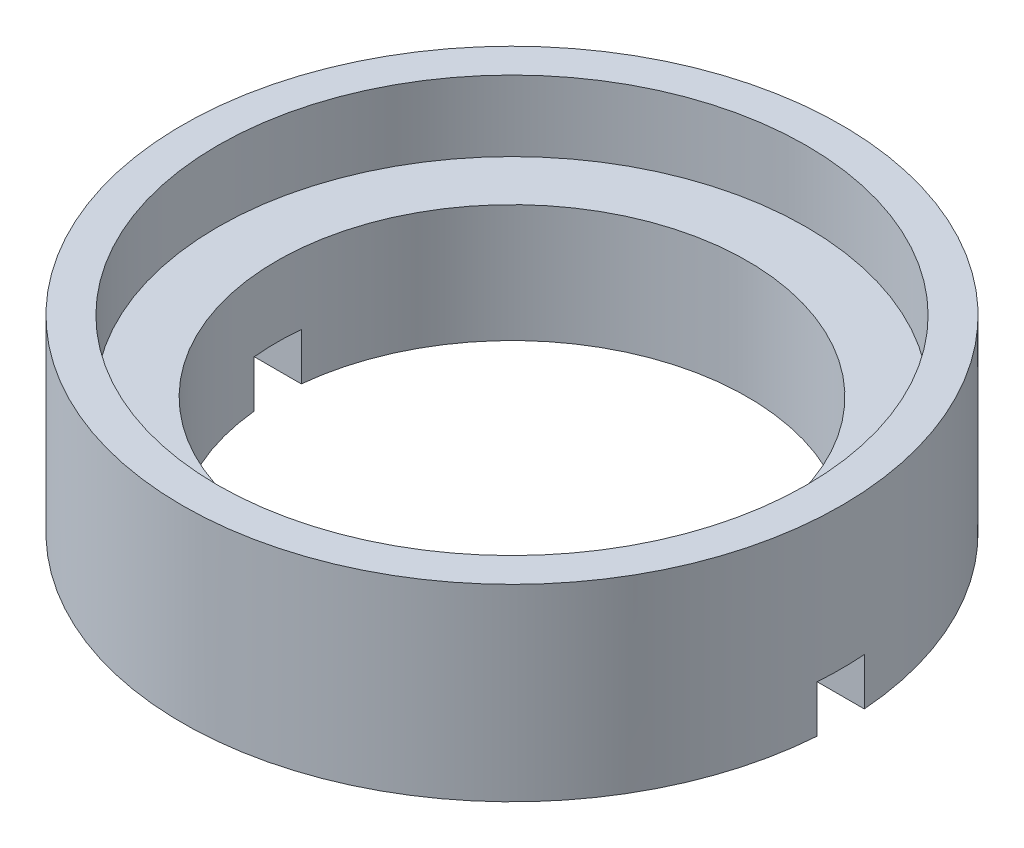
ISO-10303-21;
HEADER;
FILE_DESCRIPTION(('STEP AP214'),'2;1');
FILE_NAME('part.step','',(''),(''),'','','');
FILE_SCHEMA(('AUTOMOTIVE_DESIGN { 1 0 10303 214 1 1 1 1 }'));
ENDSEC;
DATA;
#1=APPLICATION_CONTEXT('core data for automotive mechanical design processes');
#2=APPLICATION_PROTOCOL_DEFINITION('international standard','automotive_design',2000,#1);
#3=PRODUCT_CONTEXT('',#1,'mechanical');
#4=PRODUCT('Part','Part','',(#3));
#5=PRODUCT_RELATED_PRODUCT_CATEGORY('part','',(#4));
#6=PRODUCT_DEFINITION_FORMATION('','',#4);
#7=PRODUCT_DEFINITION_CONTEXT('part definition',#1,'design');
#8=PRODUCT_DEFINITION('design','',#6,#7);
#9=PRODUCT_DEFINITION_SHAPE('','',#8);
#10=(LENGTH_UNIT() NAMED_UNIT(*) SI_UNIT(.MILLI.,.METRE.));
#11=(NAMED_UNIT(*) PLANE_ANGLE_UNIT() SI_UNIT($,.RADIAN.));
#12=(NAMED_UNIT(*) SI_UNIT($,.STERADIAN.) SOLID_ANGLE_UNIT());
#13=UNCERTAINTY_MEASURE_WITH_UNIT(LENGTH_MEASURE(1.E-05),#10,'distance_accuracy_value','');
#14=(GEOMETRIC_REPRESENTATION_CONTEXT(3) GLOBAL_UNCERTAINTY_ASSIGNED_CONTEXT((#13)) GLOBAL_UNIT_ASSIGNED_CONTEXT((#10,
#11,#12)) REPRESENTATION_CONTEXT('',''));
#15=CARTESIAN_POINT('',(0.,0.,0.));
#16=DIRECTION('',(0.,0.,1.));
#17=DIRECTION('',(1.,0.,0.));
#18=AXIS2_PLACEMENT_3D('',#15,#16,#17);
#19=CARTESIAN_POINT('',(0.,0.,0.));
#20=DIRECTION('',(0.,1.,0.));
#21=DIRECTION('',(0.,0.,1.));
#22=AXIS2_PLACEMENT_3D('',#19,#20,#21);
#23=PLANE('',#22);
#24=CARTESIAN_POINT('',(0.,0.,0.));
#25=DIRECTION('',(0.,1.,0.));
#26=DIRECTION('',(0.,0.,1.));
#27=AXIS2_PLACEMENT_3D('',#24,#25,#26);
#28=CIRCLE('',#27,7.);
#29=CARTESIAN_POINT('',(6.98212002188447,0.,-0.5));
#30=VERTEX_POINT('',#29);
#31=CARTESIAN_POINT('',(-6.98212002188447,0.,-0.5));
#32=VERTEX_POINT('',#31);
#33=EDGE_CURVE('E128',#30,#32,#28,.T.);
#34=ORIENTED_EDGE('',*,*,#33,.F.);
#35=DIRECTION('',(1.,0.,0.));
#36=VECTOR('',#35,1.);
#37=CARTESIAN_POINT('',(-8.,0.,-0.5));
#38=LINE('',#37,#36);
#39=CARTESIAN_POINT('',(4.9749371855331,0.,-0.5));
#40=VERTEX_POINT('',#39);
#41=EDGE_CURVE('E122',#40,#30,#38,.T.);
#42=ORIENTED_EDGE('',*,*,#41,.F.);
#43=CARTESIAN_POINT('',(0.,0.,0.));
#44=DIRECTION('',(0.,-1.,0.));
#45=DIRECTION('',(0.,0.,-1.));
#46=AXIS2_PLACEMENT_3D('',#43,#44,#45);
#47=CIRCLE('',#46,5.);
#48=CARTESIAN_POINT('',(-4.9749371855331,0.,-0.5));
#49=VERTEX_POINT('',#48);
#50=EDGE_CURVE('E179',#49,#40,#47,.T.);
#51=ORIENTED_EDGE('',*,*,#50,.F.);
#52=EDGE_CURVE('E163',#32,#49,#38,.T.);
#53=ORIENTED_EDGE('',*,*,#52,.F.);
#54=EDGE_LOOP('',(#34,#42,#51,#53));
#55=FACE_BOUND('',#54,.T.);
#56=ADVANCED_FACE('F39',(#55),#23,.F.);
#57=CARTESIAN_POINT('',(0.,4.,0.));
#58=DIRECTION('',(0.,-1.,0.));
#59=DIRECTION('',(0.,0.,-1.));
#60=AXIS2_PLACEMENT_3D('',#57,#58,#59);
#61=CYLINDRICAL_SURFACE('',#60,7.);
#62=CARTESIAN_POINT('',(0.,1.,0.));
#63=DIRECTION('',(0.,1.,0.));
#64=DIRECTION('',(0.,0.,1.));
#65=AXIS2_PLACEMENT_3D('',#62,#63,#64);
#66=CIRCLE('',#65,7.);
#67=CARTESIAN_POINT('',(6.98212002188447,1.,0.5));
#68=VERTEX_POINT('',#67);
#69=CARTESIAN_POINT('',(6.98212002188447,1.,-0.5));
#70=VERTEX_POINT('',#69);
#71=EDGE_CURVE('E112',#68,#70,#66,.T.);
#72=ORIENTED_EDGE('',*,*,#71,.T.);
#73=DIRECTION('',(0.,-1.,0.));
#74=VECTOR('',#73,1.);
#75=CARTESIAN_POINT('',(6.98212002188447,4.,-0.5));
#76=LINE('',#75,#74);
#77=EDGE_CURVE('E176',#70,#30,#76,.T.);
#78=ORIENTED_EDGE('',*,*,#77,.T.);
#79=ORIENTED_EDGE('',*,*,#33,.T.);
#80=DIRECTION('',(0.,-1.,0.));
#81=VECTOR('',#80,1.);
#82=CARTESIAN_POINT('',(-6.98212002188447,4.,-0.5));
#83=LINE('',#82,#81);
#84=CARTESIAN_POINT('',(-6.98212002188447,1.,-0.5));
#85=VERTEX_POINT('',#84);
#86=EDGE_CURVE('E173',#32,#85,#83,.F.);
#87=ORIENTED_EDGE('',*,*,#86,.T.);
#88=CARTESIAN_POINT('',(-6.98212002188447,1.,0.5));
#89=VERTEX_POINT('',#88);
#90=EDGE_CURVE('E170',#85,#89,#66,.T.);
#91=ORIENTED_EDGE('',*,*,#90,.T.);
#92=DIRECTION('',(0.,-1.,0.));
#93=VECTOR('',#92,1.);
#94=CARTESIAN_POINT('',(-6.98212002188447,4.,0.5));
#95=LINE('',#94,#93);
#96=CARTESIAN_POINT('',(-6.98212002188447,0.,0.5));
#97=VERTEX_POINT('',#96);
#98=EDGE_CURVE('E111',#89,#97,#95,.T.);
#99=ORIENTED_EDGE('',*,*,#98,.T.);
#100=CARTESIAN_POINT('',(6.98212002188447,0.,0.5));
#101=VERTEX_POINT('',#100);
#102=EDGE_CURVE('E119',#97,#101,#28,.T.);
#103=ORIENTED_EDGE('',*,*,#102,.T.);
#104=DIRECTION('',(0.,-1.,0.));
#105=VECTOR('',#104,1.);
#106=CARTESIAN_POINT('',(6.98212002188447,4.,0.5));
#107=LINE('',#106,#105);
#108=EDGE_CURVE('E103',#101,#68,#107,.F.);
#109=ORIENTED_EDGE('',*,*,#108,.T.);
#110=EDGE_LOOP('',(#72,#78,#79,#87,#91,#99,#103,#109));
#111=FACE_BOUND('',#110,.T.);
#112=CARTESIAN_POINT('',(0.,4.,0.));
#113=DIRECTION('',(0.,1.,0.));
#114=DIRECTION('',(0.,0.,1.));
#115=AXIS2_PLACEMENT_3D('',#112,#113,#114);
#116=CIRCLE('',#115,7.);
#117=CARTESIAN_POINT('',(0.,4.,7.));
#118=VERTEX_POINT('',#117);
#119=EDGE_CURVE('E132',#118,#118,#116,.T.);
#120=ORIENTED_EDGE('',*,*,#119,.F.);
#121=EDGE_LOOP('',(#120));
#122=FACE_BOUND('',#121,.T.);
#123=ADVANCED_FACE('F41',(#111,#122),#61,.T.);
#124=CARTESIAN_POINT('',(0.,4.,0.));
#125=DIRECTION('',(0.,1.,0.));
#126=DIRECTION('',(0.,0.,1.));
#127=AXIS2_PLACEMENT_3D('',#124,#125,#126);
#128=PLANE('',#127);
#129=CARTESIAN_POINT('',(0.,4.,0.));
#130=DIRECTION('',(0.,1.,0.));
#131=DIRECTION('',(0.,0.,1.));
#132=AXIS2_PLACEMENT_3D('',#129,#130,#131);
#133=CIRCLE('',#132,6.25);
#134=CARTESIAN_POINT('',(0.,4.,6.25));
#135=VERTEX_POINT('',#134);
#136=EDGE_CURVE('E134',#135,#135,#133,.T.);
#137=ORIENTED_EDGE('',*,*,#136,.F.);
#138=EDGE_LOOP('',(#137));
#139=FACE_BOUND('',#138,.T.);
#140=ORIENTED_EDGE('',*,*,#119,.T.);
#141=EDGE_LOOP('',(#140));
#142=FACE_BOUND('',#141,.T.);
#143=ADVANCED_FACE('F185',(#139,#142),#128,.T.);
#144=ORIENTED_EDGE('',*,*,#102,.F.);
#145=DIRECTION('',(-1.,0.,0.));
#146=VECTOR('',#145,1.);
#147=CARTESIAN_POINT('',(-8.,0.,0.5));
#148=LINE('',#147,#146);
#149=CARTESIAN_POINT('',(-4.9749371855331,0.,0.5));
#150=VERTEX_POINT('',#149);
#151=EDGE_CURVE('E123',#150,#97,#148,.T.);
#152=ORIENTED_EDGE('',*,*,#151,.F.);
#153=CARTESIAN_POINT('',(4.9749371855331,0.,0.5));
#154=VERTEX_POINT('',#153);
#155=EDGE_CURVE('E121',#154,#150,#47,.T.);
#156=ORIENTED_EDGE('',*,*,#155,.F.);
#157=EDGE_CURVE('E106',#101,#154,#148,.T.);
#158=ORIENTED_EDGE('',*,*,#157,.F.);
#159=EDGE_LOOP('',(#144,#152,#156,#158));
#160=FACE_BOUND('',#159,.T.);
#161=ADVANCED_FACE('F117',(#160),#23,.F.);
#162=CARTESIAN_POINT('',(0.,2.5,0.));
#163=DIRECTION('',(0.,1.,0.));
#164=DIRECTION('',(0.,0.,1.));
#165=AXIS2_PLACEMENT_3D('',#162,#163,#164);
#166=CYLINDRICAL_SURFACE('',#165,6.25);
#167=CARTESIAN_POINT('',(0.,2.5,0.));
#168=DIRECTION('',(0.,1.,0.));
#169=DIRECTION('',(0.,0.,1.));
#170=AXIS2_PLACEMENT_3D('',#167,#168,#169);
#171=CIRCLE('',#170,6.25);
#172=CARTESIAN_POINT('',(0.,2.5,6.25));
#173=VERTEX_POINT('',#172);
#174=EDGE_CURVE('E129',#173,#173,#171,.T.);
#175=ORIENTED_EDGE('',*,*,#174,.F.);
#176=EDGE_LOOP('',(#175));
#177=FACE_BOUND('',#176,.T.);
#178=ORIENTED_EDGE('',*,*,#136,.T.);
#179=EDGE_LOOP('',(#178));
#180=FACE_BOUND('',#179,.T.);
#181=ADVANCED_FACE('F183',(#177,#180),#166,.F.);
#182=CARTESIAN_POINT('',(0.,2.5,0.));
#183=DIRECTION('',(0.,1.,0.));
#184=DIRECTION('',(0.,0.,1.));
#185=AXIS2_PLACEMENT_3D('',#182,#183,#184);
#186=PLANE('',#185);
#187=CARTESIAN_POINT('',(0.,2.5,0.));
#188=DIRECTION('',(0.,1.,0.));
#189=DIRECTION('',(0.,0.,1.));
#190=AXIS2_PLACEMENT_3D('',#187,#188,#189);
#191=CIRCLE('',#190,5.);
#192=CARTESIAN_POINT('',(0.,2.5,5.));
#193=VERTEX_POINT('',#192);
#194=EDGE_CURVE('E139',#193,#193,#191,.T.);
#195=ORIENTED_EDGE('',*,*,#194,.F.);
#196=EDGE_LOOP('',(#195));
#197=FACE_BOUND('',#196,.T.);
#198=ORIENTED_EDGE('',*,*,#174,.T.);
#199=EDGE_LOOP('',(#198));
#200=FACE_BOUND('',#199,.T.);
#201=ADVANCED_FACE('F203',(#197,#200),#186,.T.);
#202=CARTESIAN_POINT('',(0.,4.,0.));
#203=DIRECTION('',(0.,-1.,0.));
#204=DIRECTION('',(0.,0.,-1.));
#205=AXIS2_PLACEMENT_3D('',#202,#203,#204);
#206=CYLINDRICAL_SURFACE('',#205,5.);
#207=CARTESIAN_POINT('',(0.,1.,0.));
#208=DIRECTION('',(0.,1.,0.));
#209=DIRECTION('',(0.,0.,1.));
#210=AXIS2_PLACEMENT_3D('',#207,#208,#209);
#211=CIRCLE('',#210,5.);
#212=CARTESIAN_POINT('',(-4.9749371855331,1.,0.5));
#213=VERTEX_POINT('',#212);
#214=CARTESIAN_POINT('',(-4.9749371855331,1.,-0.5));
#215=VERTEX_POINT('',#214);
#216=EDGE_CURVE('E146',#213,#215,#211,.F.);
#217=ORIENTED_EDGE('',*,*,#216,.T.);
#218=DIRECTION('',(0.,-1.,0.));
#219=VECTOR('',#218,1.);
#220=CARTESIAN_POINT('',(-4.9749371855331,4.,-0.5));
#221=LINE('',#220,#219);
#222=EDGE_CURVE('E11',#215,#49,#221,.T.);
#223=ORIENTED_EDGE('',*,*,#222,.T.);
#224=ORIENTED_EDGE('',*,*,#50,.T.);
#225=DIRECTION('',(0.,-1.,0.));
#226=VECTOR('',#225,1.);
#227=CARTESIAN_POINT('',(4.9749371855331,4.,-0.5));
#228=LINE('',#227,#226);
#229=CARTESIAN_POINT('',(4.9749371855331,1.,-0.5));
#230=VERTEX_POINT('',#229);
#231=EDGE_CURVE('E148',#40,#230,#228,.F.);
#232=ORIENTED_EDGE('',*,*,#231,.T.);
#233=CARTESIAN_POINT('',(4.9749371855331,1.,0.5));
#234=VERTEX_POINT('',#233);
#235=EDGE_CURVE('E142',#230,#234,#211,.F.);
#236=ORIENTED_EDGE('',*,*,#235,.T.);
#237=DIRECTION('',(0.,-1.,0.));
#238=VECTOR('',#237,1.);
#239=CARTESIAN_POINT('',(4.9749371855331,4.,0.5));
#240=LINE('',#239,#238);
#241=EDGE_CURVE('E145',#234,#154,#240,.T.);
#242=ORIENTED_EDGE('',*,*,#241,.T.);
#243=ORIENTED_EDGE('',*,*,#155,.T.);
#244=DIRECTION('',(0.,-1.,0.));
#245=VECTOR('',#244,1.);
#246=CARTESIAN_POINT('',(-4.9749371855331,4.,0.5));
#247=LINE('',#246,#245);
#248=EDGE_CURVE('E47',#150,#213,#247,.F.);
#249=ORIENTED_EDGE('',*,*,#248,.T.);
#250=EDGE_LOOP('',(#217,#223,#224,#232,#236,#242,#243,#249));
#251=FACE_BOUND('',#250,.T.);
#252=ORIENTED_EDGE('',*,*,#194,.T.);
#253=EDGE_LOOP('',(#252));
#254=FACE_BOUND('',#253,.T.);
#255=ADVANCED_FACE('F153',(#251,#254),#206,.F.);
#256=CARTESIAN_POINT('',(0.,1.,0.));
#257=DIRECTION('',(0.,1.,0.));
#258=DIRECTION('',(0.,0.,1.));
#259=AXIS2_PLACEMENT_3D('',#256,#257,#258);
#260=PLANE('',#259);
#261=DIRECTION('',(-1.,0.,0.));
#262=VECTOR('',#261,1.);
#263=CARTESIAN_POINT('',(-8.,1.,0.5));
#264=LINE('',#263,#262);
#265=EDGE_CURVE('E62',#68,#234,#264,.T.);
#266=ORIENTED_EDGE('',*,*,#265,.T.);
#267=ORIENTED_EDGE('',*,*,#235,.F.);
#268=DIRECTION('',(1.,0.,0.));
#269=VECTOR('',#268,1.);
#270=CARTESIAN_POINT('',(-8.,1.,-0.5));
#271=LINE('',#270,#269);
#272=EDGE_CURVE('E165',#230,#70,#271,.T.);
#273=ORIENTED_EDGE('',*,*,#272,.T.);
#274=ORIENTED_EDGE('',*,*,#71,.F.);
#275=EDGE_LOOP('',(#266,#267,#273,#274));
#276=FACE_BOUND('',#275,.T.);
#277=ADVANCED_FACE('F215',(#276),#260,.F.);
#278=CARTESIAN_POINT('',(-8.,1.,0.5));
#279=DIRECTION('',(0.,0.,1.));
#280=DIRECTION('',(1.,0.,0.));
#281=AXIS2_PLACEMENT_3D('',#278,#279,#280);
#282=PLANE('',#281);
#283=ORIENTED_EDGE('',*,*,#157,.T.);
#284=ORIENTED_EDGE('',*,*,#241,.F.);
#285=ORIENTED_EDGE('',*,*,#265,.F.);
#286=ORIENTED_EDGE('',*,*,#108,.F.);
#287=EDGE_LOOP('',(#283,#284,#285,#286));
#288=FACE_BOUND('',#287,.T.);
#289=ADVANCED_FACE('F105',(#288),#282,.F.);
#290=CARTESIAN_POINT('',(-8.,1.,-0.5));
#291=DIRECTION('',(0.,0.,-1.));
#292=DIRECTION('',(-1.,0.,0.));
#293=AXIS2_PLACEMENT_3D('',#290,#291,#292);
#294=PLANE('',#293);
#295=ORIENTED_EDGE('',*,*,#272,.F.);
#296=ORIENTED_EDGE('',*,*,#231,.F.);
#297=ORIENTED_EDGE('',*,*,#41,.T.);
#298=ORIENTED_EDGE('',*,*,#77,.F.);
#299=EDGE_LOOP('',(#295,#296,#297,#298));
#300=FACE_BOUND('',#299,.T.);
#301=ADVANCED_FACE('F219',(#300),#294,.F.);
#302=ORIENTED_EDGE('',*,*,#52,.T.);
#303=ORIENTED_EDGE('',*,*,#222,.F.);
#304=EDGE_CURVE('E54',#85,#215,#271,.T.);
#305=ORIENTED_EDGE('',*,*,#304,.F.);
#306=ORIENTED_EDGE('',*,*,#86,.F.);
#307=EDGE_LOOP('',(#302,#303,#305,#306));
#308=FACE_BOUND('',#307,.T.);
#309=ADVANCED_FACE('F218',(#308),#294,.F.);
#310=EDGE_CURVE('E160',#213,#89,#264,.T.);
#311=ORIENTED_EDGE('',*,*,#310,.F.);
#312=ORIENTED_EDGE('',*,*,#248,.F.);
#313=ORIENTED_EDGE('',*,*,#151,.T.);
#314=ORIENTED_EDGE('',*,*,#98,.F.);
#315=EDGE_LOOP('',(#311,#312,#313,#314));
#316=FACE_BOUND('',#315,.T.);
#317=ADVANCED_FACE('F162',(#316),#282,.F.);
#318=ORIENTED_EDGE('',*,*,#304,.T.);
#319=ORIENTED_EDGE('',*,*,#216,.F.);
#320=ORIENTED_EDGE('',*,*,#310,.T.);
#321=ORIENTED_EDGE('',*,*,#90,.F.);
#322=EDGE_LOOP('',(#318,#319,#320,#321));
#323=FACE_BOUND('',#322,.T.);
#324=ADVANCED_FACE('F159',(#323),#260,.F.);
#325=CLOSED_SHELL('',(#56,#123,#143,#161,#181,#201,#255,#277,#289,#301,#309,#317,#324));
#326=MANIFOLD_SOLID_BREP('B2',#325);
#327=ADVANCED_BREP_SHAPE_REPRESENTATION('',(#18,#326),#14);
#328=SHAPE_DEFINITION_REPRESENTATION(#9,#327);
ENDSEC;
END-ISO-10303-21;
